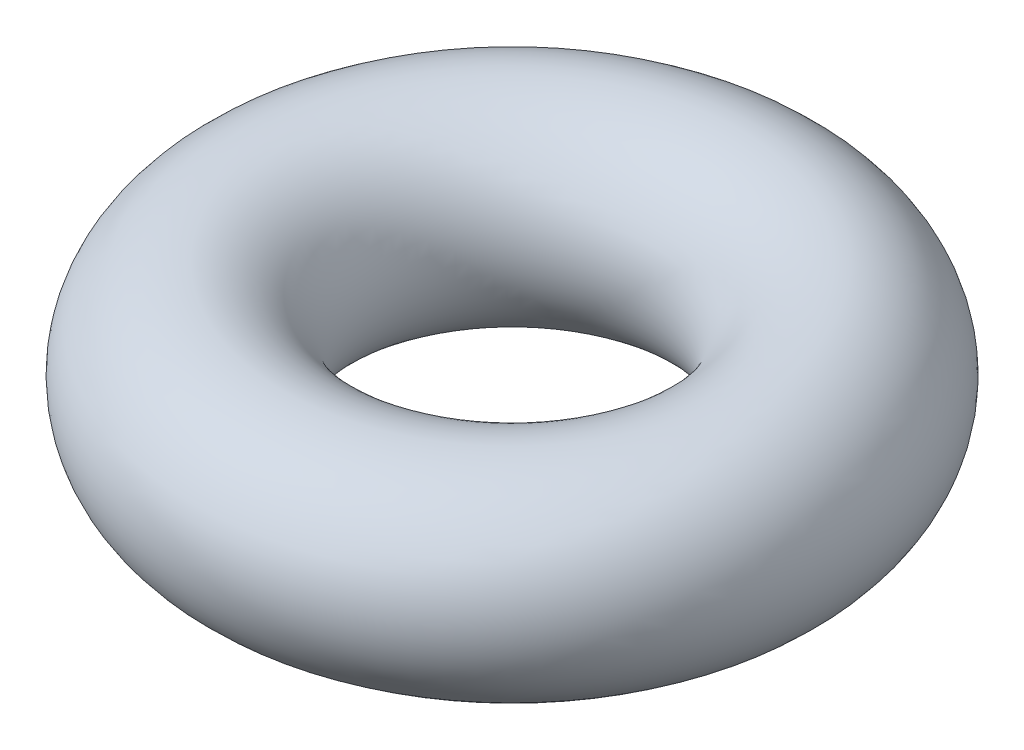
ISO-10303-21;
HEADER;
FILE_DESCRIPTION(('STEP AP214'),'2;1');
FILE_NAME('part.step','',(''),(''),'','','');
FILE_SCHEMA(('AUTOMOTIVE_DESIGN { 1 0 10303 214 1 1 1 1 }'));
ENDSEC;
DATA;
#1=APPLICATION_CONTEXT('core data for automotive mechanical design processes');
#2=APPLICATION_PROTOCOL_DEFINITION('international standard','automotive_design',2000,#1);
#3=PRODUCT_CONTEXT('',#1,'mechanical');
#4=PRODUCT('Part','Part','',(#3));
#5=PRODUCT_RELATED_PRODUCT_CATEGORY('part','',(#4));
#6=PRODUCT_DEFINITION_FORMATION('','',#4);
#7=PRODUCT_DEFINITION_CONTEXT('part definition',#1,'design');
#8=PRODUCT_DEFINITION('design','',#6,#7);
#9=PRODUCT_DEFINITION_SHAPE('','',#8);
#10=(LENGTH_UNIT() NAMED_UNIT(*) SI_UNIT(.MILLI.,.METRE.));
#11=(NAMED_UNIT(*) PLANE_ANGLE_UNIT() SI_UNIT($,.RADIAN.));
#12=(NAMED_UNIT(*) SI_UNIT($,.STERADIAN.) SOLID_ANGLE_UNIT());
#13=UNCERTAINTY_MEASURE_WITH_UNIT(LENGTH_MEASURE(1.E-05),#10,'distance_accuracy_value','');
#14=(GEOMETRIC_REPRESENTATION_CONTEXT(3) GLOBAL_UNCERTAINTY_ASSIGNED_CONTEXT((#13)) GLOBAL_UNIT_ASSIGNED_CONTEXT((#10,
#11,#12)) REPRESENTATION_CONTEXT('',''));
#15=CARTESIAN_POINT('',(0.,0.,0.));
#16=DIRECTION('',(0.,0.,1.));
#17=DIRECTION('',(1.,0.,0.));
#18=AXIS2_PLACEMENT_3D('',#15,#16,#17);
#19=CARTESIAN_POINT('',(0.,0.,0.));
#20=DIRECTION('',(0.,1.,0.));
#21=DIRECTION('',(0.,0.,1.));
#22=AXIS2_PLACEMENT_3D('',#19,#20,#21);
#23=TOROIDAL_SURFACE('',#22,2.3622,1.016);
#24=CARTESIAN_POINT('',(0.,0.,3.3782));
#25=VERTEX_POINT('',#24);
#26=VERTEX_LOOP('',#25);
#27=FACE_BOUND('',#26,.T.);
#28=ADVANCED_FACE('F27',(#27),#23,.T.);
#29=CLOSED_SHELL('',(#28));
#30=MANIFOLD_SOLID_BREP('B2',#29);
#31=ADVANCED_BREP_SHAPE_REPRESENTATION('',(#18,#30),#14);
#32=SHAPE_DEFINITION_REPRESENTATION(#9,#31);
ENDSEC;
END-ISO-10303-21;
